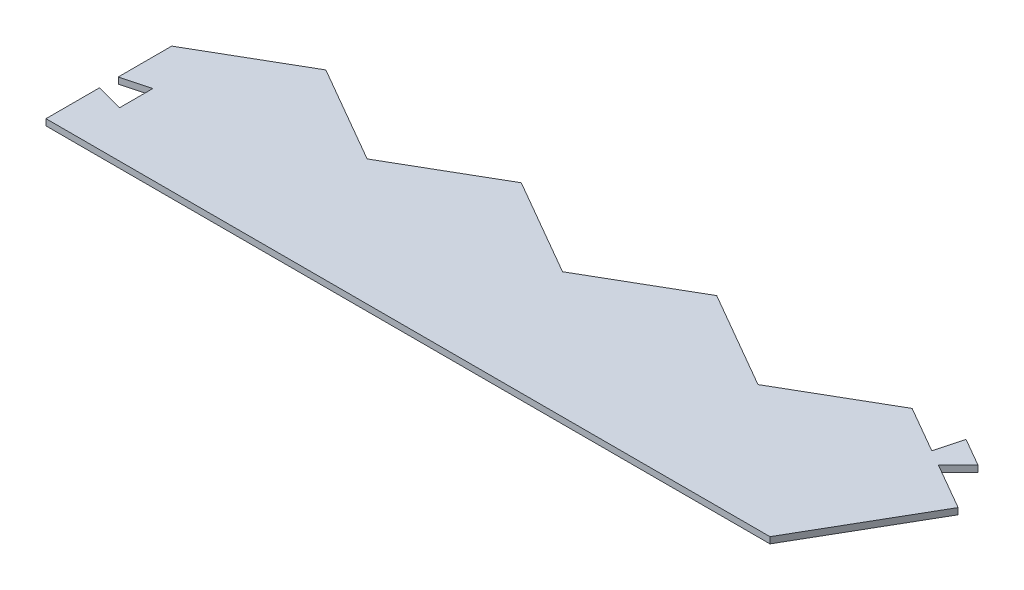
ISO-10303-21;
HEADER;
FILE_DESCRIPTION(('STEP AP214'),'2;1');
FILE_NAME('part.step','',(''),(''),'','','');
FILE_SCHEMA(('AUTOMOTIVE_DESIGN { 1 0 10303 214 1 1 1 1 }'));
ENDSEC;
DATA;
#1=APPLICATION_CONTEXT('core data for automotive mechanical design processes');
#2=APPLICATION_PROTOCOL_DEFINITION('international standard','automotive_design',2000,#1);
#3=PRODUCT_CONTEXT('',#1,'mechanical');
#4=PRODUCT('Part','Part','',(#3));
#5=PRODUCT_RELATED_PRODUCT_CATEGORY('part','',(#4));
#6=PRODUCT_DEFINITION_FORMATION('','',#4);
#7=PRODUCT_DEFINITION_CONTEXT('part definition',#1,'design');
#8=PRODUCT_DEFINITION('design','',#6,#7);
#9=PRODUCT_DEFINITION_SHAPE('','',#8);
#10=(LENGTH_UNIT() NAMED_UNIT(*) SI_UNIT(.MILLI.,.METRE.));
#11=(NAMED_UNIT(*) PLANE_ANGLE_UNIT() SI_UNIT($,.RADIAN.));
#12=(NAMED_UNIT(*) SI_UNIT($,.STERADIAN.) SOLID_ANGLE_UNIT());
#13=UNCERTAINTY_MEASURE_WITH_UNIT(LENGTH_MEASURE(1.E-05),#10,'distance_accuracy_value','');
#14=(GEOMETRIC_REPRESENTATION_CONTEXT(3) GLOBAL_UNCERTAINTY_ASSIGNED_CONTEXT((#13)) GLOBAL_UNIT_ASSIGNED_CONTEXT((#10,
#11,#12)) REPRESENTATION_CONTEXT('',''));
#15=CARTESIAN_POINT('',(0.,0.,0.));
#16=DIRECTION('',(0.,0.,1.));
#17=DIRECTION('',(1.,0.,0.));
#18=AXIS2_PLACEMENT_3D('',#15,#16,#17);
#19=CARTESIAN_POINT('',(320.386964155456,2.54,-48.1964999999965));
#20=DIRECTION('',(0.866025403784427,0.,0.50000000000002));
#21=DIRECTION('',(0.50000000000002,0.,-0.866025403784427));
#22=AXIS2_PLACEMENT_3D('',#19,#20,#21);
#23=PLANE('',#22);
#24=DIRECTION('',(-0.50000000000002,0.,0.866025403784427));
#25=VECTOR('',#24,1.);
#26=CARTESIAN_POINT('',(320.386964155456,0.,-48.1964999999965));
#27=LINE('',#26,#25);
#28=CARTESIAN_POINT('',(320.386964155456,0.,-48.1964999999965));
#29=VERTEX_POINT('',#28);
#30=CARTESIAN_POINT('',(292.560701906459,0.,0.));
#31=VERTEX_POINT('',#30);
#32=EDGE_CURVE('E207',#29,#31,#27,.T.);
#33=ORIENTED_EDGE('',*,*,#32,.F.);
#34=DIRECTION('',(0.,-1.,0.));
#35=VECTOR('',#34,1.);
#36=CARTESIAN_POINT('',(320.386964155456,2.54,-48.1964999999965));
#37=LINE('',#36,#35);
#38=CARTESIAN_POINT('',(320.386964155456,2.54,-48.1964999999965));
#39=VERTEX_POINT('',#38);
#40=EDGE_CURVE('E11',#39,#29,#37,.T.);
#41=ORIENTED_EDGE('',*,*,#40,.F.);
#42=DIRECTION('',(-0.50000000000002,0.,0.866025403784427));
#43=VECTOR('',#42,1.);
#44=CARTESIAN_POINT('',(320.386964155456,2.54,-48.1964999999965));
#45=LINE('',#44,#43);
#46=CARTESIAN_POINT('',(292.560701906459,2.54,0.));
#47=VERTEX_POINT('',#46);
#48=EDGE_CURVE('E277',#39,#47,#45,.T.);
#49=ORIENTED_EDGE('',*,*,#48,.T.);
#50=DIRECTION('',(0.,-1.,0.));
#51=VECTOR('',#50,1.);
#52=CARTESIAN_POINT('',(292.560701906459,2.54,0.));
#53=LINE('',#52,#51);
#54=EDGE_CURVE('E42',#47,#31,#53,.T.);
#55=ORIENTED_EDGE('',*,*,#54,.T.);
#56=EDGE_LOOP('',(#33,#41,#49,#55));
#57=FACE_BOUND('',#56,.T.);
#58=ADVANCED_FACE('F39',(#57),#23,.T.);
#59=CARTESIAN_POINT('',(301.57949046147,2.54,-59.0549999999971));
#60=DIRECTION('',(0.500000000000028,0.,-0.866025403784423));
#61=DIRECTION('',(-0.866025403784423,0.,-0.500000000000028));
#62=AXIS2_PLACEMENT_3D('',#59,#60,#61);
#63=PLANE('',#62);
#64=DIRECTION('',(0.866025403784422,0.,0.500000000000028));
#65=VECTOR('',#64,1.);
#66=CARTESIAN_POINT('',(301.57949046147,0.,-59.0549999999971));
#67=LINE('',#66,#65);
#68=CARTESIAN_POINT('',(301.57949046147,0.,-59.0549999999971));
#69=VERTEX_POINT('',#68);
#70=EDGE_CURVE('E274',#69,#29,#67,.T.);
#71=ORIENTED_EDGE('',*,*,#70,.F.);
#72=DIRECTION('',(0.,-1.,0.));
#73=VECTOR('',#72,1.);
#74=CARTESIAN_POINT('',(301.57949046147,2.54,-59.0549999999971));
#75=LINE('',#74,#73);
#76=CARTESIAN_POINT('',(301.57949046147,2.54,-59.0549999999971));
#77=VERTEX_POINT('',#76);
#78=EDGE_CURVE('E49',#77,#69,#75,.T.);
#79=ORIENTED_EDGE('',*,*,#78,.F.);
#80=DIRECTION('',(0.866025403784422,0.,0.500000000000028));
#81=VECTOR('',#80,1.);
#82=CARTESIAN_POINT('',(301.57949046147,2.54,-59.0549999999971));
#83=LINE('',#82,#81);
#84=EDGE_CURVE('E193',#77,#39,#83,.T.);
#85=ORIENTED_EDGE('',*,*,#84,.T.);
#86=ORIENTED_EDGE('',*,*,#40,.T.);
#87=EDGE_LOOP('',(#71,#79,#85,#86));
#88=FACE_BOUND('',#87,.T.);
#89=ADVANCED_FACE('F330',(#88),#63,.T.);
#90=CARTESIAN_POINT('',(309.571918409222,2.54,-67.047427947748));
#91=DIRECTION('',(0.707106781186491,0.,0.707106781186604));
#92=DIRECTION('',(0.707106781186604,0.,-0.707106781186491));
#93=AXIS2_PLACEMENT_3D('',#90,#91,#92);
#94=PLANE('',#93);
#95=DIRECTION('',(-0.707106781186604,0.,0.707106781186491));
#96=VECTOR('',#95,1.);
#97=CARTESIAN_POINT('',(309.571918409222,0.,-67.047427947748));
#98=LINE('',#97,#96);
#99=CARTESIAN_POINT('',(309.571918409222,0.,-67.047427947748));
#100=VERTEX_POINT('',#99);
#101=EDGE_CURVE('E179',#100,#69,#98,.T.);
#102=ORIENTED_EDGE('',*,*,#101,.F.);
#103=DIRECTION('',(0.,-1.,0.));
#104=VECTOR('',#103,1.);
#105=CARTESIAN_POINT('',(309.571918409222,2.54,-67.047427947748));
#106=LINE('',#105,#104);
#107=CARTESIAN_POINT('',(309.571918409222,2.54,-67.047427947748));
#108=VERTEX_POINT('',#107);
#109=EDGE_CURVE('E174',#108,#100,#106,.T.);
#110=ORIENTED_EDGE('',*,*,#109,.F.);
#111=DIRECTION('',(-0.707106781186604,0.,0.707106781186491));
#112=VECTOR('',#111,1.);
#113=CARTESIAN_POINT('',(309.571918409222,2.54,-67.047427947748));
#114=LINE('',#113,#112);
#115=EDGE_CURVE('E177',#108,#77,#114,.T.);
#116=ORIENTED_EDGE('',*,*,#115,.T.);
#117=ORIENTED_EDGE('',*,*,#78,.T.);
#118=EDGE_LOOP('',(#102,#110,#116,#117));
#119=FACE_BOUND('',#118,.T.);
#120=ADVANCED_FACE('F176',(#119),#94,.T.);
#121=CARTESIAN_POINT('',(298.125779003988,2.54,-73.6558596145421));
#122=DIRECTION('',(0.50000000000003,0.,-0.866025403784422));
#123=DIRECTION('',(-0.866025403784422,0.,-0.50000000000003));
#124=AXIS2_PLACEMENT_3D('',#121,#122,#123);
#125=PLANE('',#124);
#126=DIRECTION('',(0.866025403784422,0.,0.50000000000003));
#127=VECTOR('',#126,1.);
#128=CARTESIAN_POINT('',(298.125779003988,0.,-73.6558596145421));
#129=LINE('',#128,#127);
#130=CARTESIAN_POINT('',(298.125779003988,0.,-73.6558596145421));
#131=VERTEX_POINT('',#130);
#132=EDGE_CURVE('E269',#131,#100,#129,.T.);
#133=ORIENTED_EDGE('',*,*,#132,.F.);
#134=DIRECTION('',(0.,-1.,0.));
#135=VECTOR('',#134,1.);
#136=CARTESIAN_POINT('',(298.125779003988,2.54,-73.6558596145421));
#137=LINE('',#136,#135);
#138=CARTESIAN_POINT('',(298.125779003988,2.54,-73.6558596145421));
#139=VERTEX_POINT('',#138);
#140=EDGE_CURVE('E185',#139,#131,#137,.T.);
#141=ORIENTED_EDGE('',*,*,#140,.F.);
#142=DIRECTION('',(0.866025403784422,0.,0.50000000000003));
#143=VECTOR('',#142,1.);
#144=CARTESIAN_POINT('',(298.125779003988,2.54,-73.6558596145421));
#145=LINE('',#144,#143);
#146=EDGE_CURVE('E191',#139,#108,#145,.T.);
#147=ORIENTED_EDGE('',*,*,#146,.T.);
#148=ORIENTED_EDGE('',*,*,#109,.T.);
#149=EDGE_LOOP('',(#133,#141,#147,#148));
#150=FACE_BOUND('',#149,.T.);
#151=ADVANCED_FACE('F196',(#150),#125,.T.);
#152=CARTESIAN_POINT('',(295.200347337194,2.54,-62.7379999999973));
#153=DIRECTION('',(-0.965925826289047,0.,-0.258819045102599));
#154=DIRECTION('',(-0.258819045102599,0.,0.965925826289047));
#155=AXIS2_PLACEMENT_3D('',#152,#153,#154);
#156=PLANE('',#155);
#157=DIRECTION('',(0.258819045102599,0.,-0.965925826289047));
#158=VECTOR('',#157,1.);
#159=CARTESIAN_POINT('',(295.200347337194,0.,-62.7379999999973));
#160=LINE('',#159,#158);
#161=CARTESIAN_POINT('',(295.200347337194,0.,-62.7379999999973));
#162=VERTEX_POINT('',#161);
#163=EDGE_CURVE('E265',#162,#131,#160,.T.);
#164=ORIENTED_EDGE('',*,*,#163,.F.);
#165=DIRECTION('',(0.,-1.,0.));
#166=VECTOR('',#165,1.);
#167=CARTESIAN_POINT('',(295.200347337194,2.54,-62.7379999999973));
#168=LINE('',#167,#166);
#169=CARTESIAN_POINT('',(295.200347337194,2.54,-62.7379999999973));
#170=VERTEX_POINT('',#169);
#171=EDGE_CURVE('E283',#170,#162,#168,.T.);
#172=ORIENTED_EDGE('',*,*,#171,.F.);
#173=DIRECTION('',(0.258819045102599,0.,-0.965925826289047));
#174=VECTOR('',#173,1.);
#175=CARTESIAN_POINT('',(295.200347337194,2.54,-62.7379999999973));
#176=LINE('',#175,#174);
#177=EDGE_CURVE('E198',#170,#139,#176,.T.);
#178=ORIENTED_EDGE('',*,*,#177,.T.);
#179=ORIENTED_EDGE('',*,*,#140,.T.);
#180=EDGE_LOOP('',(#164,#172,#178,#179));
#181=FACE_BOUND('',#180,.T.);
#182=ADVANCED_FACE('F343',(#181),#156,.T.);
#183=CARTESIAN_POINT('',(276.392873643207,2.54,-73.5964999999979));
#184=DIRECTION('',(0.500000000000027,0.,-0.866025403784423));
#185=DIRECTION('',(-0.866025403784423,0.,-0.500000000000027));
#186=AXIS2_PLACEMENT_3D('',#183,#184,#185);
#187=PLANE('',#186);
#188=DIRECTION('',(0.866025403784423,0.,0.500000000000027));
#189=VECTOR('',#188,1.);
#190=CARTESIAN_POINT('',(276.392873643207,0.,-73.5964999999979));
#191=LINE('',#190,#189);
#192=CARTESIAN_POINT('',(276.392873643207,0.,-73.5964999999979));
#193=VERTEX_POINT('',#192);
#194=EDGE_CURVE('E261',#193,#162,#191,.T.);
#195=ORIENTED_EDGE('',*,*,#194,.F.);
#196=DIRECTION('',(0.,-1.,0.));
#197=VECTOR('',#196,1.);
#198=CARTESIAN_POINT('',(276.392873643207,2.54,-73.5964999999979));
#199=LINE('',#198,#197);
#200=CARTESIAN_POINT('',(276.392873643207,2.54,-73.5964999999979));
#201=VERTEX_POINT('',#200);
#202=EDGE_CURVE('E286',#201,#193,#199,.T.);
#203=ORIENTED_EDGE('',*,*,#202,.F.);
#204=DIRECTION('',(0.866025403784423,0.,0.500000000000027));
#205=VECTOR('',#204,1.);
#206=CARTESIAN_POINT('',(276.392873643207,2.54,-73.5964999999979));
#207=LINE('',#206,#205);
#208=EDGE_CURVE('E201',#201,#170,#207,.T.);
#209=ORIENTED_EDGE('',*,*,#208,.T.);
#210=ORIENTED_EDGE('',*,*,#171,.T.);
#211=EDGE_LOOP('',(#195,#203,#209,#210));
#212=FACE_BOUND('',#211,.T.);
#213=ADVANCED_FACE('F346',(#212),#187,.T.);
#214=CARTESIAN_POINT('',(236.908177408463,2.54,-50.7999999999986));
#215=DIRECTION('',(-0.499999999999986,0.,-0.866025403784447));
#216=DIRECTION('',(-0.866025403784447,0.,0.499999999999986));
#217=AXIS2_PLACEMENT_3D('',#214,#215,#216);
#218=PLANE('',#217);
#219=DIRECTION('',(0.866025403784447,0.,-0.499999999999986));
#220=VECTOR('',#219,1.);
#221=CARTESIAN_POINT('',(236.908177408463,0.,-50.7999999999986));
#222=LINE('',#221,#220);
#223=CARTESIAN_POINT('',(236.908177408463,0.,-50.7999999999986));
#224=VERTEX_POINT('',#223);
#225=EDGE_CURVE('E257',#224,#193,#222,.T.);
#226=ORIENTED_EDGE('',*,*,#225,.F.);
#227=DIRECTION('',(0.,-1.,0.));
#228=VECTOR('',#227,1.);
#229=CARTESIAN_POINT('',(236.908177408463,2.54,-50.7999999999986));
#230=LINE('',#229,#228);
#231=CARTESIAN_POINT('',(236.908177408463,2.54,-50.7999999999986));
#232=VERTEX_POINT('',#231);
#233=EDGE_CURVE('E289',#232,#224,#230,.T.);
#234=ORIENTED_EDGE('',*,*,#233,.F.);
#235=DIRECTION('',(0.866025403784447,0.,-0.499999999999986));
#236=VECTOR('',#235,1.);
#237=CARTESIAN_POINT('',(236.908177408463,2.54,-50.7999999999986));
#238=LINE('',#237,#236);
#239=EDGE_CURVE('E582',#232,#201,#238,.T.);
#240=ORIENTED_EDGE('',*,*,#239,.T.);
#241=ORIENTED_EDGE('',*,*,#202,.T.);
#242=EDGE_LOOP('',(#226,#234,#240,#241));
#243=FACE_BOUND('',#242,.T.);
#244=ADVANCED_FACE('F350',(#243),#218,.T.);
#245=CARTESIAN_POINT('',(197.42348117372,2.54,-73.5964999999993));
#246=DIRECTION('',(0.500000000000016,0.,-0.866025403784429));
#247=DIRECTION('',(-0.866025403784429,0.,-0.500000000000016));
#248=AXIS2_PLACEMENT_3D('',#245,#246,#247);
#249=PLANE('',#248);
#250=DIRECTION('',(0.866025403784429,0.,0.500000000000016));
#251=VECTOR('',#250,1.);
#252=CARTESIAN_POINT('',(197.42348117372,0.,-73.5964999999993));
#253=LINE('',#252,#251);
#254=CARTESIAN_POINT('',(197.42348117372,0.,-73.5964999999993));
#255=VERTEX_POINT('',#254);
#256=EDGE_CURVE('E253',#255,#224,#253,.T.);
#257=ORIENTED_EDGE('',*,*,#256,.F.);
#258=DIRECTION('',(0.,-1.,0.));
#259=VECTOR('',#258,1.);
#260=CARTESIAN_POINT('',(197.42348117372,2.54,-73.5964999999993));
#261=LINE('',#260,#259);
#262=CARTESIAN_POINT('',(197.42348117372,2.54,-73.5964999999993));
#263=VERTEX_POINT('',#262);
#264=EDGE_CURVE('E292',#263,#255,#261,.T.);
#265=ORIENTED_EDGE('',*,*,#264,.F.);
#266=DIRECTION('',(0.866025403784429,0.,0.500000000000016));
#267=VECTOR('',#266,1.);
#268=CARTESIAN_POINT('',(197.42348117372,2.54,-73.5964999999993));
#269=LINE('',#268,#267);
#270=EDGE_CURVE('E575',#263,#232,#269,.T.);
#271=ORIENTED_EDGE('',*,*,#270,.T.);
#272=ORIENTED_EDGE('',*,*,#233,.T.);
#273=EDGE_LOOP('',(#257,#265,#271,#272));
#274=FACE_BOUND('',#273,.T.);
#275=ADVANCED_FACE('F354',(#274),#249,.T.);
#276=CARTESIAN_POINT('',(157.938784938975,2.54,-50.8));
#277=DIRECTION('',(-0.499999999999984,0.,-0.866025403784448));
#278=DIRECTION('',(-0.866025403784448,0.,0.499999999999984));
#279=AXIS2_PLACEMENT_3D('',#276,#277,#278);
#280=PLANE('',#279);
#281=DIRECTION('',(0.866025403784448,0.,-0.499999999999984));
#282=VECTOR('',#281,1.);
#283=CARTESIAN_POINT('',(157.938784938975,0.,-50.8));
#284=LINE('',#283,#282);
#285=CARTESIAN_POINT('',(157.938784938975,0.,-50.8));
#286=VERTEX_POINT('',#285);
#287=EDGE_CURVE('E249',#286,#255,#284,.T.);
#288=ORIENTED_EDGE('',*,*,#287,.F.);
#289=DIRECTION('',(0.,-1.,0.));
#290=VECTOR('',#289,1.);
#291=CARTESIAN_POINT('',(157.938784938975,2.54,-50.8));
#292=LINE('',#291,#290);
#293=CARTESIAN_POINT('',(157.938784938975,2.54,-50.8));
#294=VERTEX_POINT('',#293);
#295=EDGE_CURVE('E295',#294,#286,#292,.T.);
#296=ORIENTED_EDGE('',*,*,#295,.F.);
#297=DIRECTION('',(0.866025403784448,0.,-0.499999999999984));
#298=VECTOR('',#297,1.);
#299=CARTESIAN_POINT('',(157.938784938975,2.54,-50.8));
#300=LINE('',#299,#298);
#301=EDGE_CURVE('E571',#294,#263,#300,.T.);
#302=ORIENTED_EDGE('',*,*,#301,.T.);
#303=ORIENTED_EDGE('',*,*,#264,.T.);
#304=EDGE_LOOP('',(#288,#296,#302,#303));
#305=FACE_BOUND('',#304,.T.);
#306=ADVANCED_FACE('F358',(#305),#280,.T.);
#307=CARTESIAN_POINT('',(118.454088704232,2.54,-73.5965000000008));
#308=DIRECTION('',(0.500000000000016,0.,-0.866025403784429));
#309=DIRECTION('',(-0.866025403784429,0.,-0.500000000000016));
#310=AXIS2_PLACEMENT_3D('',#307,#308,#309);
#311=PLANE('',#310);
#312=DIRECTION('',(0.866025403784429,0.,0.500000000000016));
#313=VECTOR('',#312,1.);
#314=CARTESIAN_POINT('',(118.454088704232,0.,-73.5965000000008));
#315=LINE('',#314,#313);
#316=CARTESIAN_POINT('',(118.454088704232,0.,-73.5965000000008));
#317=VERTEX_POINT('',#316);
#318=EDGE_CURVE('E245',#317,#286,#315,.T.);
#319=ORIENTED_EDGE('',*,*,#318,.F.);
#320=DIRECTION('',(0.,-1.,0.));
#321=VECTOR('',#320,1.);
#322=CARTESIAN_POINT('',(118.454088704232,2.54,-73.5965000000008));
#323=LINE('',#322,#321);
#324=CARTESIAN_POINT('',(118.454088704232,2.54,-73.5965000000008));
#325=VERTEX_POINT('',#324);
#326=EDGE_CURVE('E298',#325,#317,#323,.T.);
#327=ORIENTED_EDGE('',*,*,#326,.F.);
#328=DIRECTION('',(0.866025403784429,0.,0.500000000000016));
#329=VECTOR('',#328,1.);
#330=CARTESIAN_POINT('',(118.454088704232,2.54,-73.5965000000008));
#331=LINE('',#330,#329);
#332=EDGE_CURVE('E591',#325,#294,#331,.T.);
#333=ORIENTED_EDGE('',*,*,#332,.T.);
#334=ORIENTED_EDGE('',*,*,#295,.T.);
#335=EDGE_LOOP('',(#319,#327,#333,#334));
#336=FACE_BOUND('',#335,.T.);
#337=ADVANCED_FACE('F362',(#336),#311,.T.);
#338=CARTESIAN_POINT('',(78.9693924694879,2.54,-50.8000000000008));
#339=DIRECTION('',(-0.499999999999999,0.,-0.866025403784439));
#340=DIRECTION('',(-0.866025403784439,0.,0.499999999999999));
#341=AXIS2_PLACEMENT_3D('',#338,#339,#340);
#342=PLANE('',#341);
#343=DIRECTION('',(0.866025403784439,0.,-0.499999999999999));
#344=VECTOR('',#343,1.);
#345=CARTESIAN_POINT('',(78.9693924694879,0.,-50.8000000000008));
#346=LINE('',#345,#344);
#347=CARTESIAN_POINT('',(78.9693924694879,0.,-50.8000000000008));
#348=VERTEX_POINT('',#347);
#349=EDGE_CURVE('E241',#348,#317,#346,.T.);
#350=ORIENTED_EDGE('',*,*,#349,.F.);
#351=DIRECTION('',(0.,-1.,0.));
#352=VECTOR('',#351,1.);
#353=CARTESIAN_POINT('',(78.9693924694879,2.54,-50.8000000000008));
#354=LINE('',#353,#352);
#355=CARTESIAN_POINT('',(78.9693924694879,2.54,-50.8000000000008));
#356=VERTEX_POINT('',#355);
#357=EDGE_CURVE('E301',#356,#348,#354,.T.);
#358=ORIENTED_EDGE('',*,*,#357,.F.);
#359=DIRECTION('',(0.866025403784439,0.,-0.499999999999999));
#360=VECTOR('',#359,1.);
#361=CARTESIAN_POINT('',(78.9693924694879,2.54,-50.8000000000008));
#362=LINE('',#361,#360);
#363=EDGE_CURVE('E564',#356,#325,#362,.T.);
#364=ORIENTED_EDGE('',*,*,#363,.T.);
#365=ORIENTED_EDGE('',*,*,#326,.T.);
#366=EDGE_LOOP('',(#350,#358,#364,#365));
#367=FACE_BOUND('',#366,.T.);
#368=ADVANCED_FACE('F366',(#367),#342,.T.);
#369=CARTESIAN_POINT('',(39.4846962347437,2.54,-73.5965000000003));
#370=DIRECTION('',(0.49999999999999,0.,-0.866025403784444));
#371=DIRECTION('',(-0.866025403784444,0.,-0.49999999999999));
#372=AXIS2_PLACEMENT_3D('',#369,#370,#371);
#373=PLANE('',#372);
#374=DIRECTION('',(0.866025403784444,0.,0.49999999999999));
#375=VECTOR('',#374,1.);
#376=CARTESIAN_POINT('',(39.4846962347437,0.,-73.5965000000003));
#377=LINE('',#376,#375);
#378=CARTESIAN_POINT('',(39.4846962347437,0.,-73.5965000000003));
#379=VERTEX_POINT('',#378);
#380=EDGE_CURVE('E237',#379,#348,#377,.T.);
#381=ORIENTED_EDGE('',*,*,#380,.F.);
#382=DIRECTION('',(0.,-1.,0.));
#383=VECTOR('',#382,1.);
#384=CARTESIAN_POINT('',(39.4846962347437,2.54,-73.5965000000003));
#385=LINE('',#384,#383);
#386=CARTESIAN_POINT('',(39.4846962347437,2.54,-73.5965000000003));
#387=VERTEX_POINT('',#386);
#388=EDGE_CURVE('E304',#387,#379,#385,.T.);
#389=ORIENTED_EDGE('',*,*,#388,.F.);
#390=DIRECTION('',(0.866025403784444,0.,0.49999999999999));
#391=VECTOR('',#390,1.);
#392=CARTESIAN_POINT('',(39.4846962347437,2.54,-73.5965000000003));
#393=LINE('',#392,#391);
#394=EDGE_CURVE('E560',#387,#356,#393,.T.);
#395=ORIENTED_EDGE('',*,*,#394,.T.);
#396=ORIENTED_EDGE('',*,*,#357,.T.);
#397=EDGE_LOOP('',(#381,#389,#395,#396));
#398=FACE_BOUND('',#397,.T.);
#399=ADVANCED_FACE('F370',(#398),#373,.T.);
#400=CARTESIAN_POINT('',(0.,2.54,-50.8));
#401=DIRECTION('',(-0.500000000000008,0.,-0.866025403784434));
#402=DIRECTION('',(-0.866025403784434,0.,0.500000000000008));
#403=AXIS2_PLACEMENT_3D('',#400,#401,#402);
#404=PLANE('',#403);
#405=DIRECTION('',(0.866025403784434,0.,-0.500000000000008));
#406=VECTOR('',#405,1.);
#407=CARTESIAN_POINT('',(0.,0.,-50.8));
#408=LINE('',#407,#406);
#409=CARTESIAN_POINT('',(0.,0.,-50.8));
#410=VERTEX_POINT('',#409);
#411=EDGE_CURVE('E233',#410,#379,#408,.T.);
#412=ORIENTED_EDGE('',*,*,#411,.F.);
#413=DIRECTION('',(0.,-1.,0.));
#414=VECTOR('',#413,1.);
#415=CARTESIAN_POINT('',(0.,2.54,-50.8));
#416=LINE('',#415,#414);
#417=CARTESIAN_POINT('',(0.,2.54,-50.8));
#418=VERTEX_POINT('',#417);
#419=EDGE_CURVE('E307',#418,#410,#416,.T.);
#420=ORIENTED_EDGE('',*,*,#419,.F.);
#421=DIRECTION('',(0.866025403784434,0.,-0.500000000000008));
#422=VECTOR('',#421,1.);
#423=CARTESIAN_POINT('',(0.,2.54,-50.8));
#424=LINE('',#423,#422);
#425=EDGE_CURVE('E598',#418,#387,#424,.T.);
#426=ORIENTED_EDGE('',*,*,#425,.T.);
#427=ORIENTED_EDGE('',*,*,#388,.T.);
#428=EDGE_LOOP('',(#412,#420,#426,#427));
#429=FACE_BOUND('',#428,.T.);
#430=ADVANCED_FACE('F374',(#429),#404,.T.);
#431=CARTESIAN_POINT('',(0.,2.54,-29.21));
#432=DIRECTION('',(-1.,0.,0.));
#433=DIRECTION('',(0.,0.,1.));
#434=AXIS2_PLACEMENT_3D('',#431,#432,#433);
#435=PLANE('',#434);
#436=DIRECTION('',(0.,0.,-1.));
#437=VECTOR('',#436,1.);
#438=CARTESIAN_POINT('',(0.,0.,-29.21));
#439=LINE('',#438,#437);
#440=CARTESIAN_POINT('',(0.,0.,-29.21));
#441=VERTEX_POINT('',#440);
#442=EDGE_CURVE('E229',#441,#410,#439,.T.);
#443=ORIENTED_EDGE('',*,*,#442,.F.);
#444=DIRECTION('',(0.,-1.,0.));
#445=VECTOR('',#444,1.);
#446=CARTESIAN_POINT('',(0.,2.54,-29.21));
#447=LINE('',#446,#445);
#448=CARTESIAN_POINT('',(0.,2.54,-29.21));
#449=VERTEX_POINT('',#448);
#450=EDGE_CURVE('E310',#449,#441,#447,.T.);
#451=ORIENTED_EDGE('',*,*,#450,.F.);
#452=DIRECTION('',(0.,0.,-1.));
#453=VECTOR('',#452,1.);
#454=CARTESIAN_POINT('',(0.,2.54,-29.21));
#455=LINE('',#454,#453);
#456=EDGE_CURVE('E553',#449,#418,#455,.T.);
#457=ORIENTED_EDGE('',*,*,#456,.T.);
#458=ORIENTED_EDGE('',*,*,#419,.T.);
#459=EDGE_LOOP('',(#443,#451,#457,#458));
#460=FACE_BOUND('',#459,.T.);
#461=ADVANCED_FACE('F378',(#460),#435,.T.);
#462=CARTESIAN_POINT('',(0.,2.54,-29.21));
#463=DIRECTION('',(-0.258819045102518,0.,-0.965925826289069));
#464=DIRECTION('',(-0.965925826289069,0.,0.258819045102518));
#465=AXIS2_PLACEMENT_3D('',#462,#463,#464);
#466=PLANE('',#465);
#467=DIRECTION('',(0.965925826289069,0.,-0.258819045102518));
#468=VECTOR('',#467,1.);
#469=CARTESIAN_POINT('',(0.,0.,-29.21));
#470=LINE('',#469,#468);
#471=CARTESIAN_POINT('',(11.0405321944841,0.,-32.1683016855218));
#472=VERTEX_POINT('',#471);
#473=EDGE_CURVE('E226',#441,#472,#470,.T.);
#474=ORIENTED_EDGE('',*,*,#473,.T.);
#475=DIRECTION('',(0.,-1.,0.));
#476=VECTOR('',#475,1.);
#477=CARTESIAN_POINT('',(11.0405321944841,2.54,-32.1683016855218));
#478=LINE('',#477,#476);
#479=CARTESIAN_POINT('',(11.0405321944841,2.54,-32.1683016855218));
#480=VERTEX_POINT('',#479);
#481=EDGE_CURVE('E313',#480,#472,#478,.T.);
#482=ORIENTED_EDGE('',*,*,#481,.F.);
#483=DIRECTION('',(0.965925826289069,0.,-0.258819045102518));
#484=VECTOR('',#483,1.);
#485=CARTESIAN_POINT('',(0.,2.54,-29.21));
#486=LINE('',#485,#484);
#487=EDGE_CURVE('E548',#449,#480,#486,.T.);
#488=ORIENTED_EDGE('',*,*,#487,.F.);
#489=ORIENTED_EDGE('',*,*,#450,.T.);
#490=EDGE_LOOP('',(#474,#482,#488,#489));
#491=FACE_BOUND('',#490,.T.);
#492=ADVANCED_FACE('F382',(#491),#466,.F.);
#493=CARTESIAN_POINT('',(11.0405321944841,2.54,-32.1683016855218));
#494=DIRECTION('',(1.,0.,0.));
#495=DIRECTION('',(0.,0.,-1.));
#496=AXIS2_PLACEMENT_3D('',#493,#494,#495);
#497=PLANE('',#496);
#498=DIRECTION('',(0.,0.,1.));
#499=VECTOR('',#498,1.);
#500=CARTESIAN_POINT('',(11.0405321944841,0.,-32.1683016855218));
#501=LINE('',#500,#499);
#502=CARTESIAN_POINT('',(11.0405321944841,0.,-18.6316983144782));
#503=VERTEX_POINT('',#502);
#504=EDGE_CURVE('E223',#472,#503,#501,.T.);
#505=ORIENTED_EDGE('',*,*,#504,.T.);
#506=DIRECTION('',(0.,-1.,0.));
#507=VECTOR('',#506,1.);
#508=CARTESIAN_POINT('',(11.0405321944841,2.54,-18.6316983144782));
#509=LINE('',#508,#507);
#510=CARTESIAN_POINT('',(11.0405321944841,2.54,-18.6316983144782));
#511=VERTEX_POINT('',#510);
#512=EDGE_CURVE('E317',#511,#503,#509,.T.);
#513=ORIENTED_EDGE('',*,*,#512,.F.);
#514=DIRECTION('',(0.,0.,1.));
#515=VECTOR('',#514,1.);
#516=CARTESIAN_POINT('',(11.0405321944841,2.54,-32.1683016855218));
#517=LINE('',#516,#515);
#518=EDGE_CURVE('E545',#480,#511,#517,.T.);
#519=ORIENTED_EDGE('',*,*,#518,.F.);
#520=ORIENTED_EDGE('',*,*,#481,.T.);
#521=EDGE_LOOP('',(#505,#513,#519,#520));
#522=FACE_BOUND('',#521,.T.);
#523=ADVANCED_FACE('F386',(#522),#497,.F.);
#524=CARTESIAN_POINT('',(11.0405321944841,2.54,-18.6316983144782));
#525=DIRECTION('',(-0.258819045102517,0.,0.965925826289069));
#526=DIRECTION('',(0.965925826289069,0.,0.258819045102517));
#527=AXIS2_PLACEMENT_3D('',#524,#525,#526);
#528=PLANE('',#527);
#529=DIRECTION('',(-0.965925826289069,0.,-0.258819045102517));
#530=VECTOR('',#529,1.);
#531=CARTESIAN_POINT('',(11.0405321944841,0.,-18.6316983144782));
#532=LINE('',#531,#530);
#533=CARTESIAN_POINT('',(0.,0.,-21.59));
#534=VERTEX_POINT('',#533);
#535=EDGE_CURVE('E219',#503,#534,#532,.T.);
#536=ORIENTED_EDGE('',*,*,#535,.T.);
#537=DIRECTION('',(0.,-1.,0.));
#538=VECTOR('',#537,1.);
#539=CARTESIAN_POINT('',(0.,2.54,-21.59));
#540=LINE('',#539,#538);
#541=CARTESIAN_POINT('',(0.,2.54,-21.59));
#542=VERTEX_POINT('',#541);
#543=EDGE_CURVE('E321',#542,#534,#540,.T.);
#544=ORIENTED_EDGE('',*,*,#543,.F.);
#545=DIRECTION('',(-0.965925826289069,0.,-0.258819045102517));
#546=VECTOR('',#545,1.);
#547=CARTESIAN_POINT('',(11.0405321944841,2.54,-18.6316983144782));
#548=LINE('',#547,#546);
#549=EDGE_CURVE('E543',#511,#542,#548,.T.);
#550=ORIENTED_EDGE('',*,*,#549,.F.);
#551=ORIENTED_EDGE('',*,*,#512,.T.);
#552=EDGE_LOOP('',(#536,#544,#550,#551));
#553=FACE_BOUND('',#552,.T.);
#554=ADVANCED_FACE('F390',(#553),#528,.F.);
#555=CARTESIAN_POINT('',(0.,2.54,0.));
#556=DIRECTION('',(-1.,0.,0.));
#557=DIRECTION('',(0.,0.,1.));
#558=AXIS2_PLACEMENT_3D('',#555,#556,#557);
#559=PLANE('',#558);
#560=DIRECTION('',(0.,0.,-1.));
#561=VECTOR('',#560,1.);
#562=CARTESIAN_POINT('',(0.,0.,0.));
#563=LINE('',#562,#561);
#564=CARTESIAN_POINT('',(0.,0.,0.));
#565=VERTEX_POINT('',#564);
#566=EDGE_CURVE('E215',#565,#534,#563,.T.);
#567=ORIENTED_EDGE('',*,*,#566,.F.);
#568=DIRECTION('',(0.,-1.,0.));
#569=VECTOR('',#568,1.);
#570=CARTESIAN_POINT('',(0.,2.54,0.));
#571=LINE('',#570,#569);
#572=CARTESIAN_POINT('',(0.,2.54,0.));
#573=VERTEX_POINT('',#572);
#574=EDGE_CURVE('E323',#573,#565,#571,.T.);
#575=ORIENTED_EDGE('',*,*,#574,.F.);
#576=DIRECTION('',(0.,0.,-1.));
#577=VECTOR('',#576,1.);
#578=CARTESIAN_POINT('',(0.,2.54,0.));
#579=LINE('',#578,#577);
#580=EDGE_CURVE('E609',#573,#542,#579,.T.);
#581=ORIENTED_EDGE('',*,*,#580,.T.);
#582=ORIENTED_EDGE('',*,*,#543,.T.);
#583=EDGE_LOOP('',(#567,#575,#581,#582));
#584=FACE_BOUND('',#583,.T.);
#585=ADVANCED_FACE('F394',(#584),#559,.T.);
#586=CARTESIAN_POINT('',(78.9693924694879,2.54,0.));
#587=DIRECTION('',(0.,0.,1.));
#588=DIRECTION('',(1.,0.,0.));
#589=AXIS2_PLACEMENT_3D('',#586,#587,#588);
#590=PLANE('',#589);
#591=DIRECTION('',(-1.,0.,0.));
#592=VECTOR('',#591,1.);
#593=CARTESIAN_POINT('',(78.9693924694879,0.,0.));
#594=LINE('',#593,#592);
#595=EDGE_CURVE('E211',#31,#565,#594,.T.);
#596=ORIENTED_EDGE('',*,*,#595,.F.);
#597=ORIENTED_EDGE('',*,*,#54,.F.);
#598=DIRECTION('',(-1.,0.,0.));
#599=VECTOR('',#598,1.);
#600=CARTESIAN_POINT('',(292.560701906459,2.54,0.));
#601=LINE('',#600,#599);
#602=EDGE_CURVE('E612',#47,#573,#601,.T.);
#603=ORIENTED_EDGE('',*,*,#602,.T.);
#604=ORIENTED_EDGE('',*,*,#574,.T.);
#605=EDGE_LOOP('',(#596,#597,#603,#604));
#606=FACE_BOUND('',#605,.T.);
#607=ADVANCED_FACE('F397',(#606),#590,.T.);
#608=CARTESIAN_POINT('',(0.,2.54,0.));
#609=DIRECTION('',(0.,1.,0.));
#610=DIRECTION('',(0.,0.,1.));
#611=AXIS2_PLACEMENT_3D('',#608,#609,#610);
#612=PLANE('',#611);
#613=ORIENTED_EDGE('',*,*,#48,.F.);
#614=ORIENTED_EDGE('',*,*,#84,.F.);
#615=ORIENTED_EDGE('',*,*,#115,.F.);
#616=ORIENTED_EDGE('',*,*,#146,.F.);
#617=ORIENTED_EDGE('',*,*,#177,.F.);
#618=ORIENTED_EDGE('',*,*,#208,.F.);
#619=ORIENTED_EDGE('',*,*,#239,.F.);
#620=ORIENTED_EDGE('',*,*,#270,.F.);
#621=ORIENTED_EDGE('',*,*,#301,.F.);
#622=ORIENTED_EDGE('',*,*,#332,.F.);
#623=ORIENTED_EDGE('',*,*,#363,.F.);
#624=ORIENTED_EDGE('',*,*,#394,.F.);
#625=ORIENTED_EDGE('',*,*,#425,.F.);
#626=ORIENTED_EDGE('',*,*,#456,.F.);
#627=ORIENTED_EDGE('',*,*,#487,.T.);
#628=ORIENTED_EDGE('',*,*,#518,.T.);
#629=ORIENTED_EDGE('',*,*,#549,.T.);
#630=ORIENTED_EDGE('',*,*,#580,.F.);
#631=ORIENTED_EDGE('',*,*,#602,.F.);
#632=EDGE_LOOP('',(#613,#614,#615,#616,#617,#618,#619,#620,#621,#622,#623,#624,#625,#626,#627,
#628,#629,#630,#631));
#633=FACE_BOUND('',#632,.T.);
#634=ADVANCED_FACE('F189',(#633),#612,.T.);
#635=CARTESIAN_POINT('',(0.,0.,0.));
#636=DIRECTION('',(0.,1.,0.));
#637=DIRECTION('',(0.,0.,1.));
#638=AXIS2_PLACEMENT_3D('',#635,#636,#637);
#639=PLANE('',#638);
#640=ORIENTED_EDGE('',*,*,#32,.T.);
#641=ORIENTED_EDGE('',*,*,#595,.T.);
#642=ORIENTED_EDGE('',*,*,#566,.T.);
#643=ORIENTED_EDGE('',*,*,#535,.F.);
#644=ORIENTED_EDGE('',*,*,#504,.F.);
#645=ORIENTED_EDGE('',*,*,#473,.F.);
#646=ORIENTED_EDGE('',*,*,#442,.T.);
#647=ORIENTED_EDGE('',*,*,#411,.T.);
#648=ORIENTED_EDGE('',*,*,#380,.T.);
#649=ORIENTED_EDGE('',*,*,#349,.T.);
#650=ORIENTED_EDGE('',*,*,#318,.T.);
#651=ORIENTED_EDGE('',*,*,#287,.T.);
#652=ORIENTED_EDGE('',*,*,#256,.T.);
#653=ORIENTED_EDGE('',*,*,#225,.T.);
#654=ORIENTED_EDGE('',*,*,#194,.T.);
#655=ORIENTED_EDGE('',*,*,#163,.T.);
#656=ORIENTED_EDGE('',*,*,#132,.T.);
#657=ORIENTED_EDGE('',*,*,#101,.T.);
#658=ORIENTED_EDGE('',*,*,#70,.T.);
#659=EDGE_LOOP('',(#640,#641,#642,#643,#644,#645,#646,#647,#648,#649,#650,#651,#652,#653,#654,
#655,#656,#657,#658));
#660=FACE_BOUND('',#659,.T.);
#661=ADVANCED_FACE('F329',(#660),#639,.F.);
#662=CLOSED_SHELL('',(#58,#89,#120,#151,#182,#213,#244,#275,#306,#337,#368,#399,#430,#461,#492,
#523,#554,#585,#607,#634,#661));
#663=MANIFOLD_SOLID_BREP('B2',#662);
#664=ADVANCED_BREP_SHAPE_REPRESENTATION('',(#18,#663),#14);
#665=SHAPE_DEFINITION_REPRESENTATION(#9,#664);
ENDSEC;
END-ISO-10303-21;
